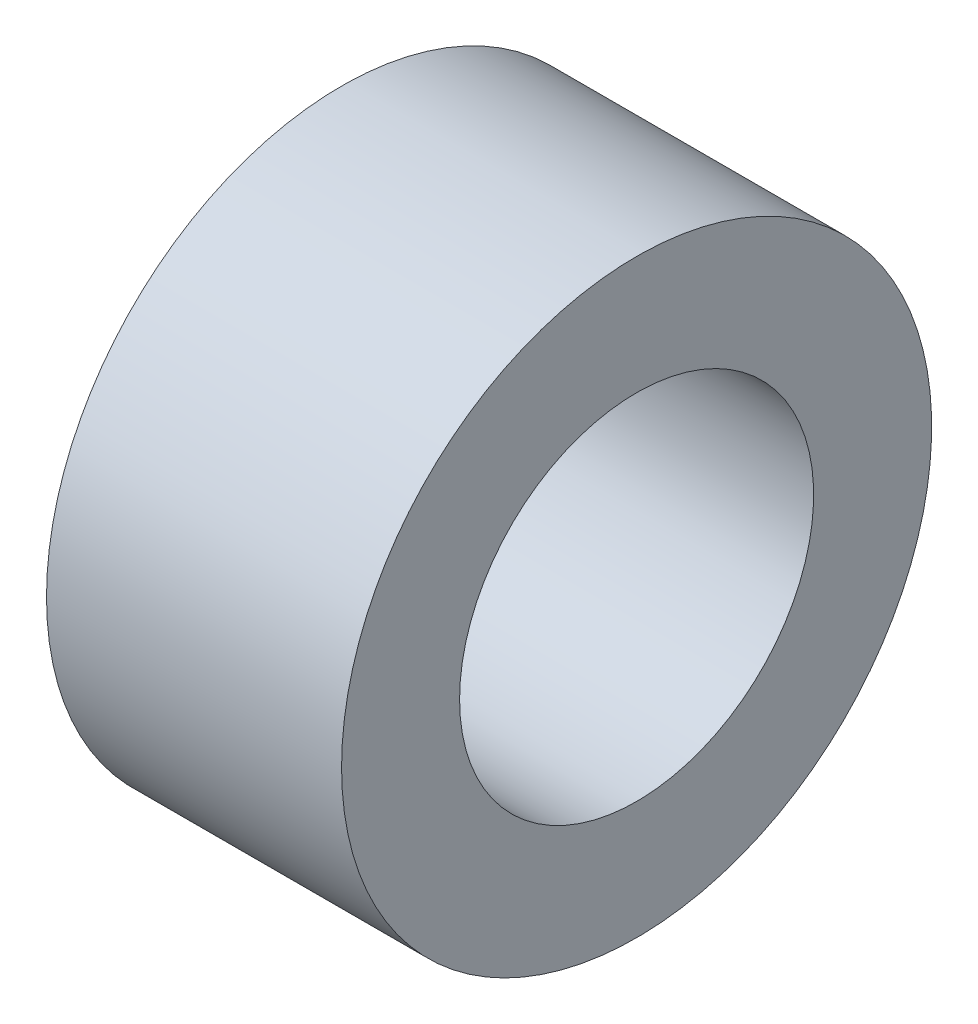
ISO-10303-21;
HEADER;
FILE_DESCRIPTION(('STEP AP214'),'2;1');
FILE_NAME('part.step','',(''),(''),'','','');
FILE_SCHEMA(('AUTOMOTIVE_DESIGN { 1 0 10303 214 1 1 1 1 }'));
ENDSEC;
DATA;
#1=APPLICATION_CONTEXT('core data for automotive mechanical design processes');
#2=APPLICATION_PROTOCOL_DEFINITION('international standard','automotive_design',2000,#1);
#3=PRODUCT_CONTEXT('',#1,'mechanical');
#4=PRODUCT('Part','Part','',(#3));
#5=PRODUCT_RELATED_PRODUCT_CATEGORY('part','',(#4));
#6=PRODUCT_DEFINITION_FORMATION('','',#4);
#7=PRODUCT_DEFINITION_CONTEXT('part definition',#1,'design');
#8=PRODUCT_DEFINITION('design','',#6,#7);
#9=PRODUCT_DEFINITION_SHAPE('','',#8);
#10=(LENGTH_UNIT() NAMED_UNIT(*) SI_UNIT(.MILLI.,.METRE.));
#11=(NAMED_UNIT(*) PLANE_ANGLE_UNIT() SI_UNIT($,.RADIAN.));
#12=(NAMED_UNIT(*) SI_UNIT($,.STERADIAN.) SOLID_ANGLE_UNIT());
#13=UNCERTAINTY_MEASURE_WITH_UNIT(LENGTH_MEASURE(1.E-05),#10,'distance_accuracy_value','');
#14=(GEOMETRIC_REPRESENTATION_CONTEXT(3) GLOBAL_UNCERTAINTY_ASSIGNED_CONTEXT((#13)) GLOBAL_UNIT_ASSIGNED_CONTEXT((#10,
#11,#12)) REPRESENTATION_CONTEXT('',''));
#15=CARTESIAN_POINT('',(0.,0.,0.));
#16=DIRECTION('',(0.,0.,1.));
#17=DIRECTION('',(1.,0.,0.));
#18=AXIS2_PLACEMENT_3D('',#15,#16,#17);
#19=CARTESIAN_POINT('',(-2.5,5.,0.));
#20=DIRECTION('',(1.,0.,0.));
#21=DIRECTION('',(0.,0.,-1.));
#22=AXIS2_PLACEMENT_3D('',#19,#20,#21);
#23=PLANE('',#22);
#24=CARTESIAN_POINT('',(-2.5,0.,0.));
#25=DIRECTION('',(-1.,0.,0.));
#26=DIRECTION('',(0.,0.,1.));
#27=AXIS2_PLACEMENT_3D('',#24,#25,#26);
#28=CIRCLE('',#27,3.);
#29=CARTESIAN_POINT('',(-2.5,0.,3.));
#30=VERTEX_POINT('',#29);
#31=EDGE_CURVE('E10',#30,#30,#28,.T.);
#32=ORIENTED_EDGE('',*,*,#31,.F.);
#33=EDGE_LOOP('',(#32));
#34=FACE_BOUND('',#33,.T.);
#35=CARTESIAN_POINT('',(-2.5,0.,0.));
#36=DIRECTION('',(-1.,0.,0.));
#37=DIRECTION('',(0.,0.,1.));
#38=AXIS2_PLACEMENT_3D('',#35,#36,#37);
#39=CIRCLE('',#38,5.);
#40=CARTESIAN_POINT('',(-2.5,0.,5.));
#41=VERTEX_POINT('',#40);
#42=EDGE_CURVE('E40',#41,#41,#39,.T.);
#43=ORIENTED_EDGE('',*,*,#42,.T.);
#44=EDGE_LOOP('',(#43));
#45=FACE_BOUND('',#44,.T.);
#46=ADVANCED_FACE('F26',(#34,#45),#23,.F.);
#47=CARTESIAN_POINT('',(-37.0031632185857,0.,0.));
#48=DIRECTION('',(-1.,0.,0.));
#49=DIRECTION('',(0.,0.,1.));
#50=AXIS2_PLACEMENT_3D('',#47,#48,#49);
#51=CYLINDRICAL_SURFACE('',#50,3.);
#52=CARTESIAN_POINT('',(2.5,0.,0.));
#53=DIRECTION('',(-1.,0.,0.));
#54=DIRECTION('',(0.,0.,1.));
#55=AXIS2_PLACEMENT_3D('',#52,#53,#54);
#56=CIRCLE('',#55,3.);
#57=CARTESIAN_POINT('',(2.5,0.,3.));
#58=VERTEX_POINT('',#57);
#59=EDGE_CURVE('E32',#58,#58,#56,.T.);
#60=ORIENTED_EDGE('',*,*,#59,.F.);
#61=EDGE_LOOP('',(#60));
#62=FACE_BOUND('',#61,.T.);
#63=ORIENTED_EDGE('',*,*,#31,.T.);
#64=EDGE_LOOP('',(#63));
#65=FACE_BOUND('',#64,.T.);
#66=ADVANCED_FACE('F55',(#62,#65),#51,.F.);
#67=CARTESIAN_POINT('',(2.5,5.,0.));
#68=DIRECTION('',(-1.,0.,0.));
#69=DIRECTION('',(0.,0.,1.));
#70=AXIS2_PLACEMENT_3D('',#67,#68,#69);
#71=PLANE('',#70);
#72=CARTESIAN_POINT('',(2.5,0.,0.));
#73=DIRECTION('',(-1.,0.,0.));
#74=DIRECTION('',(0.,0.,1.));
#75=AXIS2_PLACEMENT_3D('',#72,#73,#74);
#76=CIRCLE('',#75,5.);
#77=CARTESIAN_POINT('',(2.5,0.,5.));
#78=VERTEX_POINT('',#77);
#79=EDGE_CURVE('E36',#78,#78,#76,.T.);
#80=ORIENTED_EDGE('',*,*,#79,.F.);
#81=EDGE_LOOP('',(#80));
#82=FACE_BOUND('',#81,.T.);
#83=ORIENTED_EDGE('',*,*,#59,.T.);
#84=EDGE_LOOP('',(#83));
#85=FACE_BOUND('',#84,.T.);
#86=ADVANCED_FACE('F50',(#82,#85),#71,.F.);
#87=CARTESIAN_POINT('',(-37.0031632185857,0.,0.));
#88=DIRECTION('',(-1.,0.,0.));
#89=DIRECTION('',(0.,0.,1.));
#90=AXIS2_PLACEMENT_3D('',#87,#88,#89);
#91=CYLINDRICAL_SURFACE('',#90,5.);
#92=ORIENTED_EDGE('',*,*,#42,.F.);
#93=EDGE_LOOP('',(#92));
#94=FACE_BOUND('',#93,.T.);
#95=ORIENTED_EDGE('',*,*,#79,.T.);
#96=EDGE_LOOP('',(#95));
#97=FACE_BOUND('',#96,.T.);
#98=ADVANCED_FACE('F47',(#94,#97),#91,.T.);
#99=CLOSED_SHELL('',(#46,#66,#86,#98));
#100=MANIFOLD_SOLID_BREP('B2',#99);
#101=ADVANCED_BREP_SHAPE_REPRESENTATION('',(#18,#100),#14);
#102=SHAPE_DEFINITION_REPRESENTATION(#9,#101);
ENDSEC;
END-ISO-10303-21;
